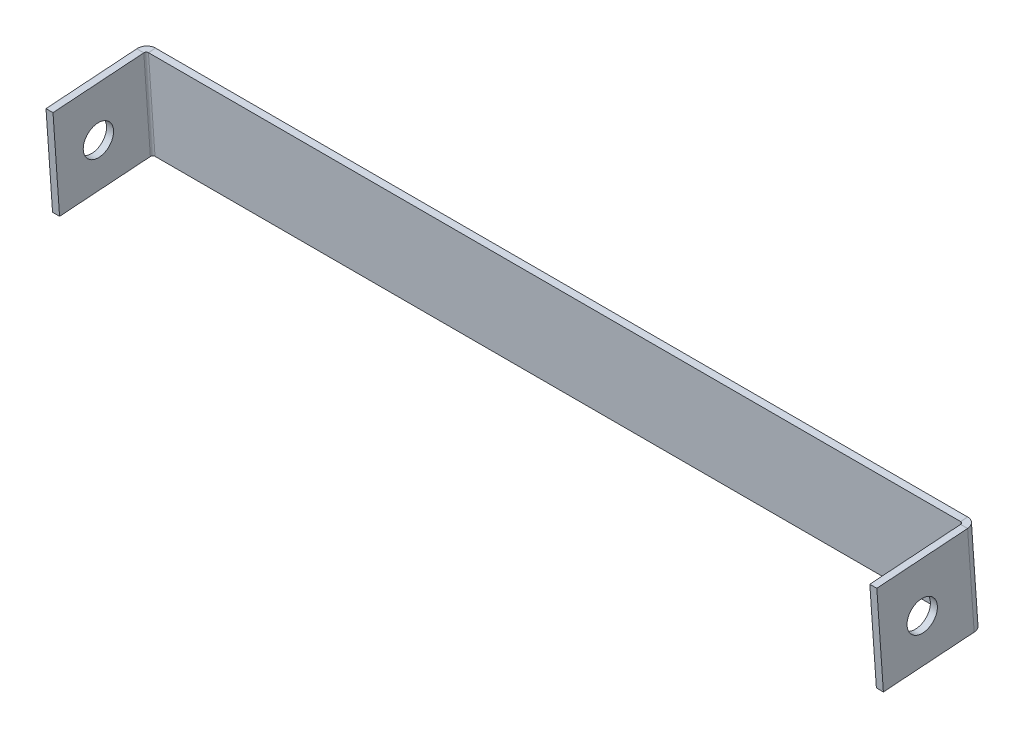
ISO-10303-21;
HEADER;
FILE_DESCRIPTION(('STEP AP214'),'2;1');
FILE_NAME('part.step','',(''),(''),'','','');
FILE_SCHEMA(('AUTOMOTIVE_DESIGN { 1 0 10303 214 1 1 1 1 }'));
ENDSEC;
DATA;
#1=APPLICATION_CONTEXT('core data for automotive mechanical design processes');
#2=APPLICATION_PROTOCOL_DEFINITION('international standard','automotive_design',2000,#1);
#3=PRODUCT_CONTEXT('',#1,'mechanical');
#4=PRODUCT('Part','Part','',(#3));
#5=PRODUCT_RELATED_PRODUCT_CATEGORY('part','',(#4));
#6=PRODUCT_DEFINITION_FORMATION('','',#4);
#7=PRODUCT_DEFINITION_CONTEXT('part definition',#1,'design');
#8=PRODUCT_DEFINITION('design','',#6,#7);
#9=PRODUCT_DEFINITION_SHAPE('','',#8);
#10=(LENGTH_UNIT() NAMED_UNIT(*) SI_UNIT(.MILLI.,.METRE.));
#11=(NAMED_UNIT(*) PLANE_ANGLE_UNIT() SI_UNIT($,.RADIAN.));
#12=(NAMED_UNIT(*) SI_UNIT($,.STERADIAN.) SOLID_ANGLE_UNIT());
#13=UNCERTAINTY_MEASURE_WITH_UNIT(LENGTH_MEASURE(1.E-05),#10,'distance_accuracy_value','');
#14=(GEOMETRIC_REPRESENTATION_CONTEXT(3) GLOBAL_UNCERTAINTY_ASSIGNED_CONTEXT((#13)) GLOBAL_UNIT_ASSIGNED_CONTEXT((#10,
#11,#12)) REPRESENTATION_CONTEXT('',''));
#15=CARTESIAN_POINT('',(0.,0.,0.));
#16=DIRECTION('',(0.,0.,1.));
#17=DIRECTION('',(1.,0.,0.));
#18=AXIS2_PLACEMENT_3D('',#15,#16,#17);
#19=CARTESIAN_POINT('',(603.682091136625,1111.17726684021,-41.4554396036412));
#20=DIRECTION('',(0.,0.997523403833771,0.0703353311209073));
#21=DIRECTION('',(0.,-0.0703353311209074,0.997523403833771));
#22=AXIS2_PLACEMENT_3D('',#19,#20,#21);
#23=PLANE('',#22);
#24=DIRECTION('',(0.,0.0703353311209115,-0.997523403833771));
#25=VECTOR('',#24,1.);
#26=CARTESIAN_POINT('',(429.182091136625,1111.07176384353,-39.9591544978906));
#27=LINE('',#26,#25);
#28=CARTESIAN_POINT('',(429.182091136625,1111.07176384353,-39.9591544978906));
#29=VERTEX_POINT('',#28);
#30=CARTESIAN_POINT('',(429.182091136625,1111.17726684021,-41.4554396036412));
#31=VERTEX_POINT('',#30);
#32=EDGE_CURVE('E220',#29,#31,#27,.T.);
#33=ORIENTED_EDGE('',*,*,#32,.T.);
#34=DIRECTION('',(-1.,0.,0.));
#35=VECTOR('',#34,1.);
#36=CARTESIAN_POINT('',(603.682091136625,1111.17726684021,-41.4554396036412));
#37=LINE('',#36,#35);
#38=CARTESIAN_POINT('',(603.182091136625,1111.17726684021,-41.4554396036412));
#39=VERTEX_POINT('',#38);
#40=EDGE_CURVE('E89',#39,#31,#37,.T.);
#41=ORIENTED_EDGE('',*,*,#40,.F.);
#42=DIRECTION('',(0.,0.0703353311208977,-0.997523403833771));
#43=VECTOR('',#42,1.);
#44=CARTESIAN_POINT('',(603.182091136625,1111.07176384353,-39.9591544978906));
#45=LINE('',#44,#43);
#46=CARTESIAN_POINT('',(603.182091136625,1111.07176384353,-39.9591544978906));
#47=VERTEX_POINT('',#46);
#48=EDGE_CURVE('E278',#47,#39,#45,.T.);
#49=ORIENTED_EDGE('',*,*,#48,.F.);
#50=DIRECTION('',(-1.,0.,0.));
#51=VECTOR('',#50,1.);
#52=CARTESIAN_POINT('',(603.682091136625,1111.07176384353,-39.9591544978905));
#53=LINE('',#52,#51);
#54=EDGE_CURVE('E280',#47,#29,#53,.T.);
#55=ORIENTED_EDGE('',*,*,#54,.T.);
#56=EDGE_LOOP('',(#33,#41,#49,#55));
#57=FACE_BOUND('',#56,.T.);
#58=ADVANCED_FACE('F81',(#57),#23,.F.);
#59=CARTESIAN_POINT('',(603.682091136625,1131.12773491688,-40.048732981223));
#60=DIRECTION('',(0.,-0.997523403833771,-0.0703353311209073));
#61=DIRECTION('',(0.,0.0703353311209074,-0.997523403833771));
#62=AXIS2_PLACEMENT_3D('',#59,#60,#61);
#63=PLANE('',#62);
#64=DIRECTION('',(0.,0.0703353311209186,-0.99752340383377));
#65=VECTOR('',#64,1.);
#66=CARTESIAN_POINT('',(429.182091136625,1131.0222319202,-38.5524478754723));
#67=LINE('',#66,#65);
#68=CARTESIAN_POINT('',(429.182091136625,1131.0222319202,-38.5524478754723));
#69=VERTEX_POINT('',#68);
#70=CARTESIAN_POINT('',(429.182091136625,1131.12773491688,-40.048732981223));
#71=VERTEX_POINT('',#70);
#72=EDGE_CURVE('E227',#69,#71,#67,.T.);
#73=ORIENTED_EDGE('',*,*,#72,.F.);
#74=DIRECTION('',(1.,0.,0.));
#75=VECTOR('',#74,1.);
#76=CARTESIAN_POINT('',(603.682091136625,1131.0222319202,-38.5524478754724));
#77=LINE('',#76,#75);
#78=CARTESIAN_POINT('',(603.182091136625,1131.0222319202,-38.5524478754724));
#79=VERTEX_POINT('',#78);
#80=EDGE_CURVE('E284',#69,#79,#77,.T.);
#81=ORIENTED_EDGE('',*,*,#80,.T.);
#82=DIRECTION('',(0.,0.0703353311209115,-0.997523403833771));
#83=VECTOR('',#82,1.);
#84=CARTESIAN_POINT('',(603.182091136625,1131.0222319202,-38.5524478754724));
#85=LINE('',#84,#83);
#86=CARTESIAN_POINT('',(603.182091136625,1131.12773491688,-40.048732981223));
#87=VERTEX_POINT('',#86);
#88=EDGE_CURVE('E268',#79,#87,#85,.T.);
#89=ORIENTED_EDGE('',*,*,#88,.T.);
#90=DIRECTION('',(1.,0.,0.));
#91=VECTOR('',#90,1.);
#92=CARTESIAN_POINT('',(603.682091136625,1131.12773491688,-40.048732981223));
#93=LINE('',#92,#91);
#94=EDGE_CURVE('E13',#71,#87,#93,.T.);
#95=ORIENTED_EDGE('',*,*,#94,.F.);
#96=EDGE_LOOP('',(#73,#81,#89,#95));
#97=FACE_BOUND('',#96,.T.);
#98=ADVANCED_FACE('F292',(#97),#63,.F.);
#99=CARTESIAN_POINT('',(0.,8.40562013718738,-119.211819678039));
#100=DIRECTION('',(0.,0.0703353311209079,-0.997523403833771));
#101=DIRECTION('',(0.,0.997523403833771,0.0703353311209079));
#102=AXIS2_PLACEMENT_3D('',#99,#100,#101);
#103=PLANE('',#102);
#104=ORIENTED_EDGE('',*,*,#40,.T.);
#105=DIRECTION('',(0.,-0.99752340383377,-0.0703353311209115));
#106=VECTOR('',#105,1.);
#107=CARTESIAN_POINT('',(429.182091136625,1111.17726684021,-41.4554396036412));
#108=LINE('',#107,#106);
#109=EDGE_CURVE('E175',#31,#71,#108,.F.);
#110=ORIENTED_EDGE('',*,*,#109,.T.);
#111=ORIENTED_EDGE('',*,*,#94,.T.);
#112=DIRECTION('',(0.,0.99752340383377,0.0703353311209115));
#113=VECTOR('',#112,1.);
#114=CARTESIAN_POINT('',(603.182091136625,1131.12773491688,-40.048732981223));
#115=LINE('',#114,#113);
#116=EDGE_CURVE('E263',#87,#39,#115,.F.);
#117=ORIENTED_EDGE('',*,*,#116,.T.);
#118=EDGE_LOOP('',(#104,#110,#111,#117));
#119=FACE_BOUND('',#118,.T.);
#120=ADVANCED_FACE('F327',(#119),#103,.T.);
#121=CARTESIAN_POINT('',(0.,8.30011714050602,-117.715534572288));
#122=DIRECTION('',(0.,0.0703353311209079,-0.997523403833771));
#123=DIRECTION('',(0.,0.997523403833771,0.0703353311209079));
#124=AXIS2_PLACEMENT_3D('',#121,#122,#123);
#125=PLANE('',#124);
#126=DIRECTION('',(0.,-0.99752340383377,-0.0703353311209115));
#127=VECTOR('',#126,1.);
#128=CARTESIAN_POINT('',(429.182091136625,1111.07176384353,-39.9591544978905));
#129=LINE('',#128,#127);
#130=EDGE_CURVE('E224',#29,#69,#129,.F.);
#131=ORIENTED_EDGE('',*,*,#130,.F.);
#132=ORIENTED_EDGE('',*,*,#54,.F.);
#133=DIRECTION('',(0.,0.99752340383377,0.0703353311209115));
#134=VECTOR('',#133,1.);
#135=CARTESIAN_POINT('',(603.182091136625,1131.0222319202,-38.5524478754724));
#136=LINE('',#135,#134);
#137=EDGE_CURVE('E274',#79,#47,#136,.F.);
#138=ORIENTED_EDGE('',*,*,#137,.F.);
#139=ORIENTED_EDGE('',*,*,#80,.F.);
#140=EDGE_LOOP('',(#131,#132,#138,#139));
#141=FACE_BOUND('',#140,.T.);
#142=ADVANCED_FACE('F297',(#141),#125,.F.);
#143=CARTESIAN_POINT('',(603.182091136625,1111.03659617796,-39.4603927959738));
#144=DIRECTION('',(0.,-0.99752340383377,-0.0703353311209115));
#145=DIRECTION('',(0.,0.0703353311209115,-0.997523403833771));
#146=AXIS2_PLACEMENT_3D('',#143,#144,#145);
#147=PLANE('',#146);
#148=DIRECTION('',(1.,0.,0.));
#149=VECTOR('',#148,1.);
#150=CARTESIAN_POINT('',(603.682091136625,1111.03659617797,-39.4603927959737));
#151=LINE('',#150,#149);
#152=CARTESIAN_POINT('',(603.682091136625,1111.03659617796,-39.4603927959738));
#153=VERTEX_POINT('',#152);
#154=CARTESIAN_POINT('',(605.182091136625,1111.03659617796,-39.4603927959738));
#155=VERTEX_POINT('',#154);
#156=EDGE_CURVE('E229',#153,#155,#151,.T.);
#157=ORIENTED_EDGE('',*,*,#156,.F.);
#158=CARTESIAN_POINT('',(603.182091136625,1111.03659617796,-39.4603927959738));
#159=DIRECTION('',(0.,0.99752340383377,0.0703353311209115));
#160=DIRECTION('',(0.,-0.0703353311209115,0.997523403833771));
#161=AXIS2_PLACEMENT_3D('',#158,#159,#160);
#162=CIRCLE('',#161,0.499999999999945);
#163=EDGE_CURVE('E271',#47,#153,#162,.F.);
#164=ORIENTED_EDGE('',*,*,#163,.F.);
#165=ORIENTED_EDGE('',*,*,#48,.T.);
#166=CARTESIAN_POINT('',(603.182091136625,1111.03659617796,-39.4603927959738));
#167=DIRECTION('',(0.,0.99752340383377,0.0703353311209115));
#168=DIRECTION('',(0.,-0.0703353311209115,0.997523403833771));
#169=AXIS2_PLACEMENT_3D('',#166,#167,#168);
#170=CIRCLE('',#169,1.99999999999994);
#171=EDGE_CURVE('E105',#39,#155,#170,.F.);
#172=ORIENTED_EDGE('',*,*,#171,.T.);
#173=EDGE_LOOP('',(#157,#164,#165,#172));
#174=FACE_BOUND('',#173,.T.);
#175=ADVANCED_FACE('F305',(#174),#147,.T.);
#176=CARTESIAN_POINT('',(603.182091136625,1130.98706425464,-38.0536861735555));
#177=DIRECTION('',(0.,-0.99752340383377,-0.0703353311209115));
#178=DIRECTION('',(0.,0.0703353311209115,-0.997523403833771));
#179=AXIS2_PLACEMENT_3D('',#176,#177,#178);
#180=PLANE('',#179);
#181=CARTESIAN_POINT('',(603.182091136625,1130.98706425464,-38.0536861735555));
#182=DIRECTION('',(0.,0.99752340383377,0.0703353311209115));
#183=DIRECTION('',(0.,-0.0703353311209115,0.997523403833771));
#184=AXIS2_PLACEMENT_3D('',#181,#182,#183);
#185=CIRCLE('',#184,0.499999999999945);
#186=CARTESIAN_POINT('',(603.682091136625,1130.98706425464,-38.0536861735555));
#187=VERTEX_POINT('',#186);
#188=EDGE_CURVE('E260',#187,#79,#185,.T.);
#189=ORIENTED_EDGE('',*,*,#188,.F.);
#190=DIRECTION('',(1.,0.,0.));
#191=VECTOR('',#190,1.);
#192=CARTESIAN_POINT('',(603.682091136625,1130.98706425464,-38.0536861735556));
#193=LINE('',#192,#191);
#194=CARTESIAN_POINT('',(605.182091136625,1130.98706425464,-38.0536861735556));
#195=VERTEX_POINT('',#194);
#196=EDGE_CURVE('E233',#187,#195,#193,.T.);
#197=ORIENTED_EDGE('',*,*,#196,.T.);
#198=CARTESIAN_POINT('',(603.182091136625,1130.98706425464,-38.0536861735555));
#199=DIRECTION('',(0.,0.99752340383377,0.0703353311209115));
#200=DIRECTION('',(0.,-0.0703353311209115,0.997523403833771));
#201=AXIS2_PLACEMENT_3D('',#198,#199,#200);
#202=CIRCLE('',#201,1.99999999999994);
#203=EDGE_CURVE('E266',#195,#87,#202,.T.);
#204=ORIENTED_EDGE('',*,*,#203,.T.);
#205=ORIENTED_EDGE('',*,*,#88,.F.);
#206=EDGE_LOOP('',(#189,#197,#204,#205));
#207=FACE_BOUND('',#206,.T.);
#208=ADVANCED_FACE('F325',(#207),#180,.F.);
#209=CARTESIAN_POINT('',(603.182091136625,1130.98706425464,-38.0536861735555));
#210=DIRECTION('',(0.,0.99752340383377,0.0703353311209115));
#211=DIRECTION('',(1.,0.,0.));
#212=AXIS2_PLACEMENT_3D('',#209,#210,#211);
#213=CYLINDRICAL_SURFACE('',#212,1.99999999999994);
#214=ORIENTED_EDGE('',*,*,#116,.F.);
#215=ORIENTED_EDGE('',*,*,#203,.F.);
#216=DIRECTION('',(0.,0.997523403833771,0.0703353311209083));
#217=VECTOR('',#216,1.);
#218=CARTESIAN_POINT('',(605.182091136625,8.26494947494564,-117.216772870372));
#219=LINE('',#218,#217);
#220=EDGE_CURVE('E236',#155,#195,#219,.T.);
#221=ORIENTED_EDGE('',*,*,#220,.F.);
#222=ORIENTED_EDGE('',*,*,#171,.F.);
#223=EDGE_LOOP('',(#214,#215,#221,#222));
#224=FACE_BOUND('',#223,.T.);
#225=ADVANCED_FACE('F376',(#224),#213,.T.);
#226=CARTESIAN_POINT('',(603.182091136625,1130.98706425464,-38.0536861735555));
#227=DIRECTION('',(0.,0.99752340383377,0.0703353311209115));
#228=DIRECTION('',(1.,0.,0.));
#229=AXIS2_PLACEMENT_3D('',#226,#227,#228);
#230=CYLINDRICAL_SURFACE('',#229,0.499999999999945);
#231=ORIENTED_EDGE('',*,*,#137,.T.);
#232=ORIENTED_EDGE('',*,*,#163,.T.);
#233=DIRECTION('',(0.,0.997523403833771,0.0703353311209083));
#234=VECTOR('',#233,1.);
#235=CARTESIAN_POINT('',(603.682091136625,1111.03659617797,-39.4603927959737));
#236=LINE('',#235,#234);
#237=EDGE_CURVE('E231',#153,#187,#236,.T.);
#238=ORIENTED_EDGE('',*,*,#237,.T.);
#239=ORIENTED_EDGE('',*,*,#188,.T.);
#240=EDGE_LOOP('',(#231,#232,#238,#239));
#241=FACE_BOUND('',#240,.T.);
#242=ADVANCED_FACE('F301',(#241),#230,.F.);
#243=CARTESIAN_POINT('',(605.182091136625,1131.0222319202,-38.5524478754724));
#244=DIRECTION('',(0.,0.997523403833773,0.0703353311208743));
#245=DIRECTION('',(0.,-0.0703353311208743,0.997523403833773));
#246=AXIS2_PLACEMENT_3D('',#243,#244,#245);
#247=PLANE('',#246);
#248=DIRECTION('',(0.,0.0703353311208743,-0.997523403833773));
#249=VECTOR('',#248,1.);
#250=CARTESIAN_POINT('',(605.182091136625,1131.0222319202,-38.5524478754724));
#251=LINE('',#250,#249);
#252=CARTESIAN_POINT('',(605.182091136625,1129.61552529778,-18.6019797987969));
#253=VERTEX_POINT('',#252);
#254=EDGE_CURVE('E248',#253,#195,#251,.T.);
#255=ORIENTED_EDGE('',*,*,#254,.T.);
#256=ORIENTED_EDGE('',*,*,#196,.F.);
#257=DIRECTION('',(0.,0.0703353311208743,-0.997523403833773));
#258=VECTOR('',#257,1.);
#259=CARTESIAN_POINT('',(603.682091136625,1131.0222319202,-38.5524478754724));
#260=LINE('',#259,#258);
#261=CARTESIAN_POINT('',(603.682091136626,1129.61552529778,-18.6019797987969));
#262=VERTEX_POINT('',#261);
#263=EDGE_CURVE('E245',#262,#187,#260,.T.);
#264=ORIENTED_EDGE('',*,*,#263,.F.);
#265=DIRECTION('',(-1.,0.,0.));
#266=VECTOR('',#265,1.);
#267=CARTESIAN_POINT('',(605.182091136625,1129.61552529778,-18.6019797987969));
#268=LINE('',#267,#266);
#269=EDGE_CURVE('E258',#253,#262,#268,.T.);
#270=ORIENTED_EDGE('',*,*,#269,.F.);
#271=EDGE_LOOP('',(#255,#256,#264,#270));
#272=FACE_BOUND('',#271,.T.);
#273=ADVANCED_FACE('F323',(#272),#247,.T.);
#274=CARTESIAN_POINT('',(605.182091136625,1109.66505722111,-20.0086864212151));
#275=DIRECTION('',(0.,-0.997523403833772,-0.0703353311208965));
#276=DIRECTION('',(0.,0.0703353311208965,-0.997523403833772));
#277=AXIS2_PLACEMENT_3D('',#274,#275,#276);
#278=PLANE('',#277);
#279=DIRECTION('',(0.,-0.0703353311208965,0.997523403833772));
#280=VECTOR('',#279,1.);
#281=CARTESIAN_POINT('',(603.682091136626,1109.66505722111,-20.0086864212151));
#282=LINE('',#281,#280);
#283=CARTESIAN_POINT('',(603.682091136626,1109.66505722111,-20.0086864212151));
#284=VERTEX_POINT('',#283);
#285=EDGE_CURVE('E241',#153,#284,#282,.T.);
#286=ORIENTED_EDGE('',*,*,#285,.F.);
#287=ORIENTED_EDGE('',*,*,#156,.T.);
#288=DIRECTION('',(0.,-0.0703353311208965,0.997523403833772));
#289=VECTOR('',#288,1.);
#290=CARTESIAN_POINT('',(605.182091136625,1109.66505722111,-20.0086864212151));
#291=LINE('',#290,#289);
#292=CARTESIAN_POINT('',(605.182091136625,1109.66505722111,-20.0086864212151));
#293=VERTEX_POINT('',#292);
#294=EDGE_CURVE('E242',#155,#293,#291,.T.);
#295=ORIENTED_EDGE('',*,*,#294,.T.);
#296=DIRECTION('',(-1.,0.,0.));
#297=VECTOR('',#296,1.);
#298=CARTESIAN_POINT('',(605.182091136625,1109.66505722111,-20.0086864212151));
#299=LINE('',#298,#297);
#300=EDGE_CURVE('E251',#293,#284,#299,.T.);
#301=ORIENTED_EDGE('',*,*,#300,.T.);
#302=EDGE_LOOP('',(#286,#287,#295,#301));
#303=FACE_BOUND('',#302,.T.);
#304=ADVANCED_FACE('F309',(#303),#278,.T.);
#305=CARTESIAN_POINT('',(605.182091136626,2.36061484053439E-13,-3.34791706151561E-12));
#306=DIRECTION('',(1.,0.,0.));
#307=DIRECTION('',(0.,0.,-1.));
#308=AXIS2_PLACEMENT_3D('',#305,#306,#307);
#309=PLANE('',#308);
#310=CARTESIAN_POINT('',(605.182091136625,1119.64029125944,-28.3278329861758));
#311=DIRECTION('',(1.,0.,0.));
#312=DIRECTION('',(0.,0.,-1.));
#313=AXIS2_PLACEMENT_3D('',#310,#311,#312);
#314=CIRCLE('',#313,3.25000000000004);
#315=CARTESIAN_POINT('',(605.182091136625,1119.64029125944,-31.5778329861758));
#316=VERTEX_POINT('',#315);
#317=EDGE_CURVE('E339',#316,#316,#314,.T.);
#318=ORIENTED_EDGE('',*,*,#317,.F.);
#319=EDGE_LOOP('',(#318));
#320=FACE_BOUND('',#319,.T.);
#321=ORIENTED_EDGE('',*,*,#294,.F.);
#322=ORIENTED_EDGE('',*,*,#220,.T.);
#323=ORIENTED_EDGE('',*,*,#254,.F.);
#324=DIRECTION('',(0.,0.997523403833771,0.070335331120907));
#325=VECTOR('',#324,1.);
#326=CARTESIAN_POINT('',(605.182091136625,1129.61552529778,-18.6019797987969));
#327=LINE('',#326,#325);
#328=EDGE_CURVE('E244',#293,#253,#327,.T.);
#329=ORIENTED_EDGE('',*,*,#328,.F.);
#330=EDGE_LOOP('',(#321,#322,#323,#329));
#331=FACE_BOUND('',#330,.T.);
#332=ADVANCED_FACE('F313',(#320,#331),#309,.T.);
#333=CARTESIAN_POINT('',(603.682091136626,2.35701346062193E-13,-3.34280944249752E-12));
#334=DIRECTION('',(1.,0.,0.));
#335=DIRECTION('',(0.,0.,-1.));
#336=AXIS2_PLACEMENT_3D('',#333,#334,#335);
#337=PLANE('',#336);
#338=CARTESIAN_POINT('',(603.682091136626,1119.64029125944,-28.3278329861758));
#339=DIRECTION('',(1.,0.,0.));
#340=DIRECTION('',(0.,0.,-1.));
#341=AXIS2_PLACEMENT_3D('',#338,#339,#340);
#342=CIRCLE('',#341,3.25000000000004);
#343=CARTESIAN_POINT('',(603.682091136626,1119.64029125944,-31.5778329861758));
#344=VERTEX_POINT('',#343);
#345=EDGE_CURVE('E454',#344,#344,#342,.T.);
#346=ORIENTED_EDGE('',*,*,#345,.T.);
#347=EDGE_LOOP('',(#346));
#348=FACE_BOUND('',#347,.T.);
#349=ORIENTED_EDGE('',*,*,#237,.F.);
#350=ORIENTED_EDGE('',*,*,#285,.T.);
#351=DIRECTION('',(0.,0.997523403833771,0.070335331120907));
#352=VECTOR('',#351,1.);
#353=CARTESIAN_POINT('',(603.682091136626,1129.61552529778,-18.6019797987969));
#354=LINE('',#353,#352);
#355=EDGE_CURVE('E253',#284,#262,#354,.T.);
#356=ORIENTED_EDGE('',*,*,#355,.T.);
#357=ORIENTED_EDGE('',*,*,#263,.T.);
#358=EDGE_LOOP('',(#349,#350,#356,#357));
#359=FACE_BOUND('',#358,.T.);
#360=ADVANCED_FACE('F320',(#348,#359),#337,.F.);
#361=CARTESIAN_POINT('',(605.182091136625,1129.61552529778,-18.6019797987969));
#362=DIRECTION('',(0.,-0.070335331120907,0.997523403833771));
#363=DIRECTION('',(0.,-0.997523403833771,-0.070335331120907));
#364=AXIS2_PLACEMENT_3D('',#361,#362,#363);
#365=PLANE('',#364);
#366=ORIENTED_EDGE('',*,*,#355,.F.);
#367=ORIENTED_EDGE('',*,*,#300,.F.);
#368=ORIENTED_EDGE('',*,*,#328,.T.);
#369=ORIENTED_EDGE('',*,*,#269,.T.);
#370=EDGE_LOOP('',(#366,#367,#368,#369));
#371=FACE_BOUND('',#370,.T.);
#372=ADVANCED_FACE('F317',(#371),#365,.T.);
#373=CARTESIAN_POINT('',(429.182091136625,1130.98706425464,-38.0536861735555));
#374=DIRECTION('',(0.,0.99752340383377,0.0703353311209115));
#375=DIRECTION('',(0.,-0.0703353311209115,0.997523403833771));
#376=AXIS2_PLACEMENT_3D('',#373,#374,#375);
#377=PLANE('',#376);
#378=DIRECTION('',(-1.,0.,0.));
#379=VECTOR('',#378,1.);
#380=CARTESIAN_POINT('',(428.682091136625,1130.98706425464,-38.0536861735555));
#381=LINE('',#380,#379);
#382=CARTESIAN_POINT('',(428.682091136625,1130.98706425464,-38.0536861735555));
#383=VERTEX_POINT('',#382);
#384=CARTESIAN_POINT('',(427.182091136625,1130.98706425464,-38.0536861735555));
#385=VERTEX_POINT('',#384);
#386=EDGE_CURVE('E336',#383,#385,#381,.T.);
#387=ORIENTED_EDGE('',*,*,#386,.F.);
#388=CARTESIAN_POINT('',(429.182091136625,1130.98706425464,-38.0536861735555));
#389=DIRECTION('',(0.,-0.99752340383377,-0.0703353311209115));
#390=DIRECTION('',(0.,0.0703353311209115,-0.997523403833771));
#391=AXIS2_PLACEMENT_3D('',#388,#389,#390);
#392=CIRCLE('',#391,0.499999999999945);
#393=EDGE_CURVE('E178',#69,#383,#392,.F.);
#394=ORIENTED_EDGE('',*,*,#393,.F.);
#395=ORIENTED_EDGE('',*,*,#72,.T.);
#396=CARTESIAN_POINT('',(429.182091136625,1130.98706425464,-38.0536861735555));
#397=DIRECTION('',(0.,-0.99752340383377,-0.0703353311209115));
#398=DIRECTION('',(0.,0.0703353311209115,-0.997523403833771));
#399=AXIS2_PLACEMENT_3D('',#396,#397,#398);
#400=CIRCLE('',#399,1.99999999999994);
#401=EDGE_CURVE('E97',#71,#385,#400,.F.);
#402=ORIENTED_EDGE('',*,*,#401,.T.);
#403=EDGE_LOOP('',(#387,#394,#395,#402));
#404=FACE_BOUND('',#403,.T.);
#405=ADVANCED_FACE('F387',(#404),#377,.T.);
#406=CARTESIAN_POINT('',(429.182091136625,1111.03659617796,-39.4603927959737));
#407=DIRECTION('',(0.,0.99752340383377,0.0703353311209115));
#408=DIRECTION('',(0.,-0.0703353311209115,0.997523403833771));
#409=AXIS2_PLACEMENT_3D('',#406,#407,#408);
#410=PLANE('',#409);
#411=CARTESIAN_POINT('',(429.182091136625,1111.03659617796,-39.4603927959737));
#412=DIRECTION('',(0.,-0.99752340383377,-0.0703353311209115));
#413=DIRECTION('',(0.,0.0703353311209115,-0.997523403833771));
#414=AXIS2_PLACEMENT_3D('',#411,#412,#413);
#415=CIRCLE('',#414,0.499999999999945);
#416=CARTESIAN_POINT('',(428.682091136625,1111.03659617796,-39.4603927959737));
#417=VERTEX_POINT('',#416);
#418=EDGE_CURVE('E185',#417,#29,#415,.T.);
#419=ORIENTED_EDGE('',*,*,#418,.F.);
#420=DIRECTION('',(-1.,0.,0.));
#421=VECTOR('',#420,1.);
#422=CARTESIAN_POINT('',(428.682091136625,1111.03659617796,-39.4603927959737));
#423=LINE('',#422,#421);
#424=CARTESIAN_POINT('',(427.182091136625,1111.03659617796,-39.4603927959737));
#425=VERTEX_POINT('',#424);
#426=EDGE_CURVE('E182',#417,#425,#423,.T.);
#427=ORIENTED_EDGE('',*,*,#426,.T.);
#428=CARTESIAN_POINT('',(429.182091136625,1111.03659617796,-39.4603927959737));
#429=DIRECTION('',(0.,-0.99752340383377,-0.0703353311209115));
#430=DIRECTION('',(0.,0.0703353311209115,-0.997523403833771));
#431=AXIS2_PLACEMENT_3D('',#428,#429,#430);
#432=CIRCLE('',#431,1.99999999999994);
#433=EDGE_CURVE('E169',#425,#31,#432,.T.);
#434=ORIENTED_EDGE('',*,*,#433,.T.);
#435=ORIENTED_EDGE('',*,*,#32,.F.);
#436=EDGE_LOOP('',(#419,#427,#434,#435));
#437=FACE_BOUND('',#436,.T.);
#438=ADVANCED_FACE('F183',(#437),#410,.F.);
#439=CARTESIAN_POINT('',(429.182091136625,1111.03659617796,-39.4603927959737));
#440=DIRECTION('',(0.,-0.99752340383377,-0.0703353311209115));
#441=DIRECTION('',(-1.,0.,0.));
#442=AXIS2_PLACEMENT_3D('',#439,#440,#441);
#443=CYLINDRICAL_SURFACE('',#442,1.99999999999994);
#444=ORIENTED_EDGE('',*,*,#109,.F.);
#445=ORIENTED_EDGE('',*,*,#433,.F.);
#446=DIRECTION('',(0.,0.997523403833771,0.0703353311209079));
#447=VECTOR('',#446,1.);
#448=CARTESIAN_POINT('',(427.182091136622,8.26494947494438,-117.216772870372));
#449=LINE('',#448,#447);
#450=EDGE_CURVE('E173',#425,#385,#449,.T.);
#451=ORIENTED_EDGE('',*,*,#450,.T.);
#452=ORIENTED_EDGE('',*,*,#401,.F.);
#453=EDGE_LOOP('',(#444,#445,#451,#452));
#454=FACE_BOUND('',#453,.T.);
#455=ADVANCED_FACE('F171',(#454),#443,.T.);
#456=CARTESIAN_POINT('',(429.182091136625,1111.03659617796,-39.4603927959737));
#457=DIRECTION('',(0.,-0.99752340383377,-0.0703353311209115));
#458=DIRECTION('',(-1.,0.,0.));
#459=AXIS2_PLACEMENT_3D('',#456,#457,#458);
#460=CYLINDRICAL_SURFACE('',#459,0.499999999999945);
#461=ORIENTED_EDGE('',*,*,#130,.T.);
#462=ORIENTED_EDGE('',*,*,#393,.T.);
#463=DIRECTION('',(0.,-0.997523403833771,-0.0703353311209079));
#464=VECTOR('',#463,1.);
#465=CARTESIAN_POINT('',(428.682091136625,1130.98706425464,-38.0536861735555));
#466=LINE('',#465,#464);
#467=EDGE_CURVE('E190',#383,#417,#466,.T.);
#468=ORIENTED_EDGE('',*,*,#467,.T.);
#469=ORIENTED_EDGE('',*,*,#418,.T.);
#470=EDGE_LOOP('',(#461,#462,#468,#469));
#471=FACE_BOUND('',#470,.T.);
#472=ADVANCED_FACE('F331',(#471),#460,.F.);
#473=CARTESIAN_POINT('',(427.182091136625,1131.0222319202,-38.5524478754724));
#474=DIRECTION('',(0.,0.997523403833772,0.0703353311208965));
#475=DIRECTION('',(0.,-0.0703353311208965,0.997523403833772));
#476=AXIS2_PLACEMENT_3D('',#473,#474,#475);
#477=PLANE('',#476);
#478=DIRECTION('',(0.,-0.0703353311208965,0.997523403833772));
#479=VECTOR('',#478,1.);
#480=CARTESIAN_POINT('',(428.682091136625,1131.0222319202,-38.5524478754724));
#481=LINE('',#480,#479);
#482=CARTESIAN_POINT('',(428.682091136625,1129.61552529778,-18.6019797987969));
#483=VERTEX_POINT('',#482);
#484=EDGE_CURVE('E200',#383,#483,#481,.T.);
#485=ORIENTED_EDGE('',*,*,#484,.F.);
#486=ORIENTED_EDGE('',*,*,#386,.T.);
#487=DIRECTION('',(0.,-0.0703353311208965,0.997523403833772));
#488=VECTOR('',#487,1.);
#489=CARTESIAN_POINT('',(427.182091136625,1131.0222319202,-38.5524478754724));
#490=LINE('',#489,#488);
#491=CARTESIAN_POINT('',(427.182091136625,1129.61552529778,-18.6019797987969));
#492=VERTEX_POINT('',#491);
#493=EDGE_CURVE('E199',#385,#492,#490,.T.);
#494=ORIENTED_EDGE('',*,*,#493,.T.);
#495=DIRECTION('',(1.,0.,0.));
#496=VECTOR('',#495,1.);
#497=CARTESIAN_POINT('',(427.182091136625,1129.61552529778,-18.6019797987969));
#498=LINE('',#497,#496);
#499=EDGE_CURVE('E204',#492,#483,#498,.T.);
#500=ORIENTED_EDGE('',*,*,#499,.T.);
#501=EDGE_LOOP('',(#485,#486,#494,#500));
#502=FACE_BOUND('',#501,.T.);
#503=ADVANCED_FACE('F345',(#502),#477,.T.);
#504=CARTESIAN_POINT('',(427.182091136625,1109.66505722111,-20.0086864212151));
#505=DIRECTION('',(0.,-0.997523403833769,-0.0703353311209298));
#506=DIRECTION('',(0.,0.0703353311209298,-0.997523403833769));
#507=AXIS2_PLACEMENT_3D('',#504,#505,#506);
#508=PLANE('',#507);
#509=DIRECTION('',(0.,0.0703353311209298,-0.997523403833769));
#510=VECTOR('',#509,1.);
#511=CARTESIAN_POINT('',(427.182091136625,1109.66505722111,-20.0086864212151));
#512=LINE('',#511,#510);
#513=CARTESIAN_POINT('',(427.182091136625,1109.66505722111,-20.0086864212151));
#514=VERTEX_POINT('',#513);
#515=EDGE_CURVE('E197',#514,#425,#512,.T.);
#516=ORIENTED_EDGE('',*,*,#515,.T.);
#517=ORIENTED_EDGE('',*,*,#426,.F.);
#518=DIRECTION('',(0.,0.0703353311209298,-0.997523403833769));
#519=VECTOR('',#518,1.);
#520=CARTESIAN_POINT('',(428.682091136625,1109.66505722111,-20.0086864212151));
#521=LINE('',#520,#519);
#522=CARTESIAN_POINT('',(428.682091136625,1109.66505722111,-20.0086864212151));
#523=VERTEX_POINT('',#522);
#524=EDGE_CURVE('E216',#523,#417,#521,.T.);
#525=ORIENTED_EDGE('',*,*,#524,.F.);
#526=DIRECTION('',(1.,0.,0.));
#527=VECTOR('',#526,1.);
#528=CARTESIAN_POINT('',(427.182091136625,1109.66505722111,-20.0086864212151));
#529=LINE('',#528,#527);
#530=EDGE_CURVE('E203',#514,#523,#529,.T.);
#531=ORIENTED_EDGE('',*,*,#530,.F.);
#532=EDGE_LOOP('',(#516,#517,#525,#531));
#533=FACE_BOUND('',#532,.T.);
#534=ADVANCED_FACE('F202',(#533),#508,.T.);
#535=CARTESIAN_POINT('',(427.182091136622,-1.26604257007904E-12,1.09814810642556E-12));
#536=DIRECTION('',(1.,0.,0.));
#537=DIRECTION('',(0.,1.,0.));
#538=AXIS2_PLACEMENT_3D('',#535,#536,#537);
#539=PLANE('',#538);
#540=CARTESIAN_POINT('',(427.182091136625,1119.64029125944,-28.3278329861762));
#541=DIRECTION('',(-1.,0.,0.));
#542=DIRECTION('',(0.,-1.,0.));
#543=AXIS2_PLACEMENT_3D('',#540,#541,#542);
#544=CIRCLE('',#543,3.25000000000004);
#545=CARTESIAN_POINT('',(427.182091136625,1116.39029125944,-28.3278329861762));
#546=VERTEX_POINT('',#545);
#547=EDGE_CURVE('E456',#546,#546,#544,.T.);
#548=ORIENTED_EDGE('',*,*,#547,.F.);
#549=EDGE_LOOP('',(#548));
#550=FACE_BOUND('',#549,.T.);
#551=ORIENTED_EDGE('',*,*,#450,.F.);
#552=ORIENTED_EDGE('',*,*,#515,.F.);
#553=DIRECTION('',(0.,-0.997523403833771,-0.0703353311209076));
#554=VECTOR('',#553,1.);
#555=CARTESIAN_POINT('',(427.182091136625,1129.61552529778,-18.6019797987969));
#556=LINE('',#555,#554);
#557=EDGE_CURVE('E205',#492,#514,#556,.T.);
#558=ORIENTED_EDGE('',*,*,#557,.F.);
#559=ORIENTED_EDGE('',*,*,#493,.F.);
#560=EDGE_LOOP('',(#551,#552,#558,#559));
#561=FACE_BOUND('',#560,.T.);
#562=ADVANCED_FACE('F195',(#550,#561),#539,.F.);
#563=CARTESIAN_POINT('',(428.682091136622,-1.27057230164503E-12,1.10319787163107E-12));
#564=DIRECTION('',(1.,0.,0.));
#565=DIRECTION('',(0.,1.,0.));
#566=AXIS2_PLACEMENT_3D('',#563,#564,#565);
#567=PLANE('',#566);
#568=CARTESIAN_POINT('',(428.682091136625,1119.64029125944,-28.3278329861762));
#569=DIRECTION('',(1.,0.,0.));
#570=DIRECTION('',(0.,1.,0.));
#571=AXIS2_PLACEMENT_3D('',#568,#569,#570);
#572=CIRCLE('',#571,3.25000000000004);
#573=CARTESIAN_POINT('',(428.682091136625,1122.89029125944,-28.3278329861762));
#574=VERTEX_POINT('',#573);
#575=EDGE_CURVE('E84',#574,#574,#572,.T.);
#576=ORIENTED_EDGE('',*,*,#575,.F.);
#577=EDGE_LOOP('',(#576));
#578=FACE_BOUND('',#577,.T.);
#579=ORIENTED_EDGE('',*,*,#524,.T.);
#580=ORIENTED_EDGE('',*,*,#467,.F.);
#581=ORIENTED_EDGE('',*,*,#484,.T.);
#582=DIRECTION('',(0.,-0.997523403833771,-0.0703353311209076));
#583=VECTOR('',#582,1.);
#584=CARTESIAN_POINT('',(428.682091136625,1129.61552529778,-18.6019797987969));
#585=LINE('',#584,#583);
#586=EDGE_CURVE('E213',#483,#523,#585,.T.);
#587=ORIENTED_EDGE('',*,*,#586,.T.);
#588=EDGE_LOOP('',(#579,#580,#581,#587));
#589=FACE_BOUND('',#588,.T.);
#590=ADVANCED_FACE('F349',(#578,#589),#567,.T.);
#591=CARTESIAN_POINT('',(427.182091136625,1129.61552529778,-18.6019797987969));
#592=DIRECTION('',(0.,-0.0703353311209076,0.997523403833771));
#593=DIRECTION('',(0.,-0.997523403833771,-0.0703353311209077));
#594=AXIS2_PLACEMENT_3D('',#591,#592,#593);
#595=PLANE('',#594);
#596=ORIENTED_EDGE('',*,*,#586,.F.);
#597=ORIENTED_EDGE('',*,*,#499,.F.);
#598=ORIENTED_EDGE('',*,*,#557,.T.);
#599=ORIENTED_EDGE('',*,*,#530,.T.);
#600=EDGE_LOOP('',(#596,#597,#598,#599));
#601=FACE_BOUND('',#600,.T.);
#602=ADVANCED_FACE('F348',(#601),#595,.T.);
#603=CARTESIAN_POINT('',(623.682091136627,1119.64029125944,-28.3278329861757));
#604=DIRECTION('',(-1.,0.,0.));
#605=DIRECTION('',(0.,-1.,0.));
#606=AXIS2_PLACEMENT_3D('',#603,#604,#605);
#607=CYLINDRICAL_SURFACE('',#606,3.25000000000004);
#608=ORIENTED_EDGE('',*,*,#575,.T.);
#609=EDGE_LOOP('',(#608));
#610=FACE_BOUND('',#609,.T.);
#611=ORIENTED_EDGE('',*,*,#547,.T.);
#612=EDGE_LOOP('',(#611));
#613=FACE_BOUND('',#612,.T.);
#614=ADVANCED_FACE('F357',(#610,#613),#607,.F.);
#615=ORIENTED_EDGE('',*,*,#317,.T.);
#616=EDGE_LOOP('',(#615));
#617=FACE_BOUND('',#616,.T.);
#618=ORIENTED_EDGE('',*,*,#345,.F.);
#619=EDGE_LOOP('',(#618));
#620=FACE_BOUND('',#619,.T.);
#621=ADVANCED_FACE('F436',(#617,#620),#607,.F.);
#622=CLOSED_SHELL('',(#58,#98,#120,#142,#175,#208,#225,#242,#273,#304,#332,#360,#372,#405,#438,
#455,#472,#503,#534,#562,#590,#602,#614,#621));
#623=MANIFOLD_SOLID_BREP('B2',#622);
#624=ADVANCED_BREP_SHAPE_REPRESENTATION('',(#18,#623),#14);
#625=SHAPE_DEFINITION_REPRESENTATION(#9,#624);
ENDSEC;
END-ISO-10303-21;
